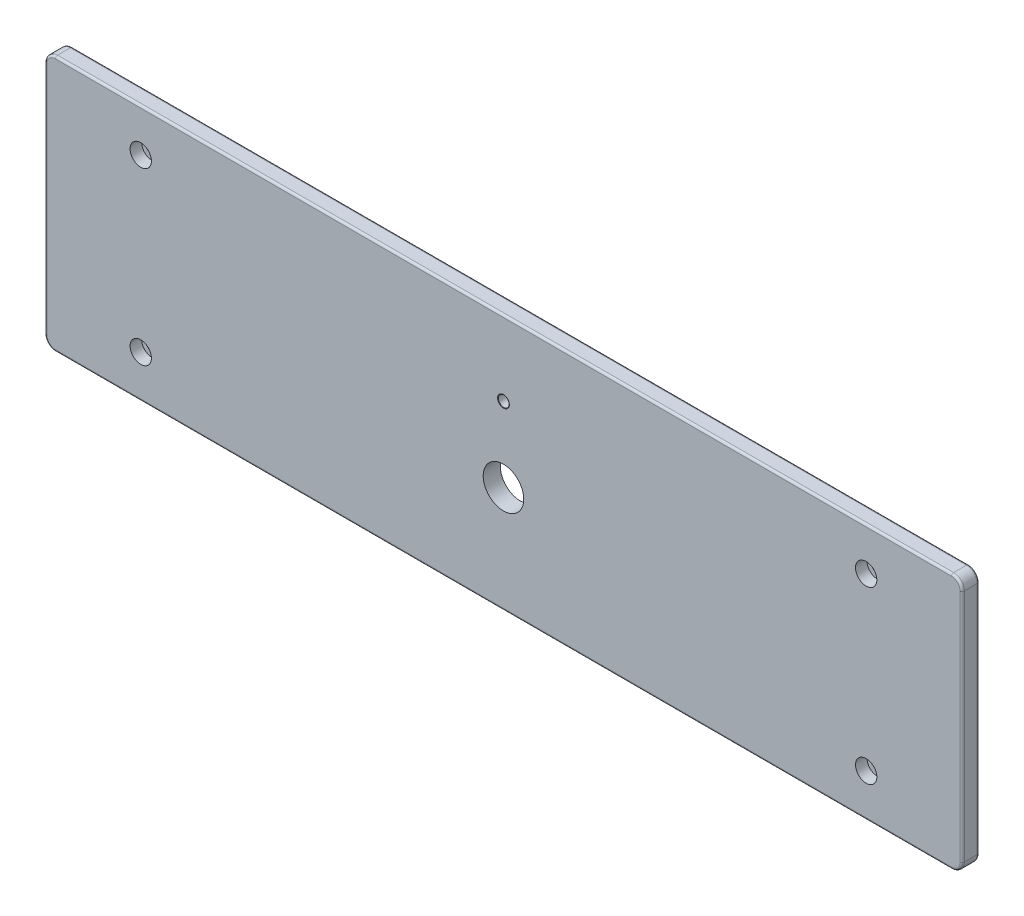
ISO-10303-21;
HEADER;
FILE_DESCRIPTION(('STEP AP214'),'2;1');
FILE_NAME('part.step','',(''),(''),'','','');
FILE_SCHEMA(('AUTOMOTIVE_DESIGN { 1 0 10303 214 1 1 1 1 }'));
ENDSEC;
DATA;
#1=APPLICATION_CONTEXT('core data for automotive mechanical design processes');
#2=APPLICATION_PROTOCOL_DEFINITION('international standard','automotive_design',2000,#1);
#3=PRODUCT_CONTEXT('',#1,'mechanical');
#4=PRODUCT('Part','Part','',(#3));
#5=PRODUCT_RELATED_PRODUCT_CATEGORY('part','',(#4));
#6=PRODUCT_DEFINITION_FORMATION('','',#4);
#7=PRODUCT_DEFINITION_CONTEXT('part definition',#1,'design');
#8=PRODUCT_DEFINITION('design','',#6,#7);
#9=PRODUCT_DEFINITION_SHAPE('','',#8);
#10=(LENGTH_UNIT() NAMED_UNIT(*) SI_UNIT(.MILLI.,.METRE.));
#11=(NAMED_UNIT(*) PLANE_ANGLE_UNIT() SI_UNIT($,.RADIAN.));
#12=(NAMED_UNIT(*) SI_UNIT($,.STERADIAN.) SOLID_ANGLE_UNIT());
#13=UNCERTAINTY_MEASURE_WITH_UNIT(LENGTH_MEASURE(1.E-05),#10,'distance_accuracy_value','');
#14=(GEOMETRIC_REPRESENTATION_CONTEXT(3) GLOBAL_UNCERTAINTY_ASSIGNED_CONTEXT((#13)) GLOBAL_UNIT_ASSIGNED_CONTEXT((#10,
#11,#12)) REPRESENTATION_CONTEXT('',''));
#15=CARTESIAN_POINT('',(0.,0.,0.));
#16=DIRECTION('',(0.,0.,1.));
#17=DIRECTION('',(1.,0.,0.));
#18=AXIS2_PLACEMENT_3D('',#15,#16,#17);
#19=CARTESIAN_POINT('',(0.,0.,8.));
#20=DIRECTION('',(1.,0.,0.));
#21=DIRECTION('',(0.,0.,-1.));
#22=AXIS2_PLACEMENT_3D('',#19,#20,#21);
#23=PLANE('',#22);
#24=DIRECTION('',(0.,0.,-1.));
#25=VECTOR('',#24,1.);
#26=CARTESIAN_POINT('',(0.,115.,8.));
#27=LINE('',#26,#25);
#28=CARTESIAN_POINT('',(0.,115.,7.));
#29=VERTEX_POINT('',#28);
#30=CARTESIAN_POINT('',(0.,115.,1.));
#31=VERTEX_POINT('',#30);
#32=EDGE_CURVE('E392',#29,#31,#27,.T.);
#33=ORIENTED_EDGE('',*,*,#32,.T.);
#34=DIRECTION('',(0.,-1.,0.));
#35=VECTOR('',#34,1.);
#36=CARTESIAN_POINT('',(0.,5.,1.));
#37=LINE('',#36,#35);
#38=CARTESIAN_POINT('',(0.,5.,1.));
#39=VERTEX_POINT('',#38);
#40=EDGE_CURVE('E199',#31,#39,#37,.T.);
#41=ORIENTED_EDGE('',*,*,#40,.T.);
#42=DIRECTION('',(0.,0.,-1.));
#43=VECTOR('',#42,1.);
#44=CARTESIAN_POINT('',(0.,5.,8.));
#45=LINE('',#44,#43);
#46=CARTESIAN_POINT('',(0.,5.,7.));
#47=VERTEX_POINT('',#46);
#48=EDGE_CURVE('E394',#39,#47,#45,.F.);
#49=ORIENTED_EDGE('',*,*,#48,.T.);
#50=DIRECTION('',(0.,-1.,0.));
#51=VECTOR('',#50,1.);
#52=CARTESIAN_POINT('',(0.,0.,7.));
#53=LINE('',#52,#51);
#54=EDGE_CURVE('E197',#47,#29,#53,.F.);
#55=ORIENTED_EDGE('',*,*,#54,.T.);
#56=EDGE_LOOP('',(#33,#41,#49,#55));
#57=FACE_BOUND('',#56,.T.);
#58=ADVANCED_FACE('F33',(#57),#23,.F.);
#59=CARTESIAN_POINT('',(0.,0.,8.));
#60=DIRECTION('',(0.,1.,0.));
#61=DIRECTION('',(0.,0.,1.));
#62=AXIS2_PLACEMENT_3D('',#59,#60,#61);
#63=PLANE('',#62);
#64=DIRECTION('',(0.,0.,-1.));
#65=VECTOR('',#64,1.);
#66=CARTESIAN_POINT('',(5.,0.,8.));
#67=LINE('',#66,#65);
#68=CARTESIAN_POINT('',(5.,0.,7.));
#69=VERTEX_POINT('',#68);
#70=CARTESIAN_POINT('',(5.,0.,1.));
#71=VERTEX_POINT('',#70);
#72=EDGE_CURVE('E386',#69,#71,#67,.T.);
#73=ORIENTED_EDGE('',*,*,#72,.T.);
#74=DIRECTION('',(1.,0.,0.));
#75=VECTOR('',#74,1.);
#76=CARTESIAN_POINT('',(425.,0.,1.));
#77=LINE('',#76,#75);
#78=CARTESIAN_POINT('',(425.,0.,1.));
#79=VERTEX_POINT('',#78);
#80=EDGE_CURVE('E207',#71,#79,#77,.T.);
#81=ORIENTED_EDGE('',*,*,#80,.T.);
#82=DIRECTION('',(0.,0.,-1.));
#83=VECTOR('',#82,1.);
#84=CARTESIAN_POINT('',(425.,0.,8.));
#85=LINE('',#84,#83);
#86=CARTESIAN_POINT('',(425.,0.,7.));
#87=VERTEX_POINT('',#86);
#88=EDGE_CURVE('E164',#79,#87,#85,.F.);
#89=ORIENTED_EDGE('',*,*,#88,.T.);
#90=DIRECTION('',(1.,0.,0.));
#91=VECTOR('',#90,1.);
#92=CARTESIAN_POINT('',(0.,0.,7.));
#93=LINE('',#92,#91);
#94=EDGE_CURVE('E205',#87,#69,#93,.F.);
#95=ORIENTED_EDGE('',*,*,#94,.T.);
#96=EDGE_LOOP('',(#73,#81,#89,#95));
#97=FACE_BOUND('',#96,.T.);
#98=ADVANCED_FACE('F289',(#97),#63,.F.);
#99=CARTESIAN_POINT('',(430.,0.,8.));
#100=DIRECTION('',(-1.,0.,0.));
#101=DIRECTION('',(0.,0.,1.));
#102=AXIS2_PLACEMENT_3D('',#99,#100,#101);
#103=PLANE('',#102);
#104=DIRECTION('',(0.,0.,-1.));
#105=VECTOR('',#104,1.);
#106=CARTESIAN_POINT('',(430.,5.,8.));
#107=LINE('',#106,#105);
#108=CARTESIAN_POINT('',(430.,5.,7.));
#109=VERTEX_POINT('',#108);
#110=CARTESIAN_POINT('',(430.,5.,1.));
#111=VERTEX_POINT('',#110);
#112=EDGE_CURVE('E403',#109,#111,#107,.T.);
#113=ORIENTED_EDGE('',*,*,#112,.T.);
#114=DIRECTION('',(0.,1.,0.));
#115=VECTOR('',#114,1.);
#116=CARTESIAN_POINT('',(430.,115.,1.));
#117=LINE('',#116,#115);
#118=CARTESIAN_POINT('',(430.,115.,1.));
#119=VERTEX_POINT('',#118);
#120=EDGE_CURVE('E215',#111,#119,#117,.T.);
#121=ORIENTED_EDGE('',*,*,#120,.T.);
#122=DIRECTION('',(0.,0.,-1.));
#123=VECTOR('',#122,1.);
#124=CARTESIAN_POINT('',(430.,115.,8.));
#125=LINE('',#124,#123);
#126=CARTESIAN_POINT('',(430.,115.,7.));
#127=VERTEX_POINT('',#126);
#128=EDGE_CURVE('E400',#119,#127,#125,.F.);
#129=ORIENTED_EDGE('',*,*,#128,.T.);
#130=DIRECTION('',(0.,1.,0.));
#131=VECTOR('',#130,1.);
#132=CARTESIAN_POINT('',(430.,0.,7.));
#133=LINE('',#132,#131);
#134=EDGE_CURVE('E213',#127,#109,#133,.F.);
#135=ORIENTED_EDGE('',*,*,#134,.T.);
#136=EDGE_LOOP('',(#113,#121,#129,#135));
#137=FACE_BOUND('',#136,.T.);
#138=ADVANCED_FACE('F295',(#137),#103,.F.);
#139=CARTESIAN_POINT('',(0.,120.,8.));
#140=DIRECTION('',(0.,-1.,0.));
#141=DIRECTION('',(0.,0.,-1.));
#142=AXIS2_PLACEMENT_3D('',#139,#140,#141);
#143=PLANE('',#142);
#144=DIRECTION('',(0.,0.,-1.));
#145=VECTOR('',#144,1.);
#146=CARTESIAN_POINT('',(425.,120.,8.));
#147=LINE('',#146,#145);
#148=CARTESIAN_POINT('',(425.,120.,7.));
#149=VERTEX_POINT('',#148);
#150=CARTESIAN_POINT('',(425.,120.,1.));
#151=VERTEX_POINT('',#150);
#152=EDGE_CURVE('E171',#149,#151,#147,.T.);
#153=ORIENTED_EDGE('',*,*,#152,.T.);
#154=DIRECTION('',(-1.,0.,0.));
#155=VECTOR('',#154,1.);
#156=CARTESIAN_POINT('',(5.,120.,1.));
#157=LINE('',#156,#155);
#158=CARTESIAN_POINT('',(5.,120.,1.));
#159=VERTEX_POINT('',#158);
#160=EDGE_CURVE('E234',#151,#159,#157,.T.);
#161=ORIENTED_EDGE('',*,*,#160,.T.);
#162=DIRECTION('',(0.,0.,-1.));
#163=VECTOR('',#162,1.);
#164=CARTESIAN_POINT('',(5.,120.,8.));
#165=LINE('',#164,#163);
#166=CARTESIAN_POINT('',(5.,120.,7.));
#167=VERTEX_POINT('',#166);
#168=EDGE_CURVE('E175',#159,#167,#165,.F.);
#169=ORIENTED_EDGE('',*,*,#168,.T.);
#170=DIRECTION('',(-1.,0.,0.));
#171=VECTOR('',#170,1.);
#172=CARTESIAN_POINT('',(0.,120.,7.));
#173=LINE('',#172,#171);
#174=EDGE_CURVE('E232',#167,#149,#173,.F.);
#175=ORIENTED_EDGE('',*,*,#174,.T.);
#176=EDGE_LOOP('',(#153,#161,#169,#175));
#177=FACE_BOUND('',#176,.T.);
#178=ADVANCED_FACE('F408',(#177),#143,.F.);
#179=CARTESIAN_POINT('',(0.,120.,8.));
#180=DIRECTION('',(0.,0.,-1.));
#181=DIRECTION('',(-1.,0.,0.));
#182=AXIS2_PLACEMENT_3D('',#179,#180,#181);
#183=PLANE('',#182);
#184=CARTESIAN_POINT('',(215.,85.,8.));
#185=DIRECTION('',(0.,0.,-1.));
#186=DIRECTION('',(-1.,0.,0.));
#187=AXIS2_PLACEMENT_3D('',#184,#185,#186);
#188=CIRCLE('',#187,2.74999999999995);
#189=CARTESIAN_POINT('',(212.25,85.,8.));
#190=VERTEX_POINT('',#189);
#191=EDGE_CURVE('E11',#190,#190,#188,.T.);
#192=ORIENTED_EDGE('',*,*,#191,.T.);
#193=EDGE_LOOP('',(#192));
#194=FACE_BOUND('',#193,.T.);
#195=CARTESIAN_POINT('',(215.,50.,8.));
#196=DIRECTION('',(0.,0.,1.));
#197=DIRECTION('',(1.,0.,0.));
#198=AXIS2_PLACEMENT_3D('',#195,#196,#197);
#199=CIRCLE('',#198,9.49999999999998);
#200=CARTESIAN_POINT('',(224.5,50.,8.));
#201=VERTEX_POINT('',#200);
#202=EDGE_CURVE('E839',#201,#201,#199,.T.);
#203=ORIENTED_EDGE('',*,*,#202,.F.);
#204=EDGE_LOOP('',(#203));
#205=FACE_BOUND('',#204,.T.);
#206=CARTESIAN_POINT('',(45.,100.,8.));
#207=DIRECTION('',(0.,0.,1.));
#208=DIRECTION('',(1.,0.,0.));
#209=AXIS2_PLACEMENT_3D('',#206,#207,#208);
#210=CIRCLE('',#209,4.99999999999999);
#211=CARTESIAN_POINT('',(50.,100.,8.));
#212=VERTEX_POINT('',#211);
#213=EDGE_CURVE('E756',#212,#212,#210,.T.);
#214=ORIENTED_EDGE('',*,*,#213,.F.);
#215=EDGE_LOOP('',(#214));
#216=FACE_BOUND('',#215,.T.);
#217=CARTESIAN_POINT('',(45.,20.,8.));
#218=DIRECTION('',(0.,0.,1.));
#219=DIRECTION('',(1.,0.,0.));
#220=AXIS2_PLACEMENT_3D('',#217,#218,#219);
#221=CIRCLE('',#220,4.99999999999999);
#222=CARTESIAN_POINT('',(50.,20.,8.));
#223=VERTEX_POINT('',#222);
#224=EDGE_CURVE('E772',#223,#223,#221,.T.);
#225=ORIENTED_EDGE('',*,*,#224,.F.);
#226=EDGE_LOOP('',(#225));
#227=FACE_BOUND('',#226,.T.);
#228=CARTESIAN_POINT('',(385.,20.,8.));
#229=DIRECTION('',(0.,0.,1.));
#230=DIRECTION('',(1.,0.,0.));
#231=AXIS2_PLACEMENT_3D('',#228,#229,#230);
#232=CIRCLE('',#231,5.);
#233=CARTESIAN_POINT('',(390.,20.,8.));
#234=VERTEX_POINT('',#233);
#235=EDGE_CURVE('E784',#234,#234,#232,.T.);
#236=ORIENTED_EDGE('',*,*,#235,.F.);
#237=EDGE_LOOP('',(#236));
#238=FACE_BOUND('',#237,.T.);
#239=CARTESIAN_POINT('',(385.,100.,8.));
#240=DIRECTION('',(0.,0.,1.));
#241=DIRECTION('',(1.,0.,0.));
#242=AXIS2_PLACEMENT_3D('',#239,#240,#241);
#243=CIRCLE('',#242,5.);
#244=CARTESIAN_POINT('',(390.,100.,8.));
#245=VERTEX_POINT('',#244);
#246=EDGE_CURVE('E796',#245,#245,#243,.T.);
#247=ORIENTED_EDGE('',*,*,#246,.F.);
#248=EDGE_LOOP('',(#247));
#249=FACE_BOUND('',#248,.T.);
#250=CARTESIAN_POINT('',(425.,5.,8.));
#251=DIRECTION('',(0.,0.,-1.));
#252=DIRECTION('',(-1.,0.,0.));
#253=AXIS2_PLACEMENT_3D('',#250,#251,#252);
#254=CIRCLE('',#253,4.);
#255=CARTESIAN_POINT('',(425.,1.,8.));
#256=VERTEX_POINT('',#255);
#257=CARTESIAN_POINT('',(429.,5.,8.));
#258=VERTEX_POINT('',#257);
#259=EDGE_CURVE('E48',#256,#258,#254,.F.);
#260=ORIENTED_EDGE('',*,*,#259,.T.);
#261=DIRECTION('',(0.,1.,0.));
#262=VECTOR('',#261,1.);
#263=CARTESIAN_POINT('',(429.,120.,8.));
#264=LINE('',#263,#262);
#265=CARTESIAN_POINT('',(429.,115.,8.));
#266=VERTEX_POINT('',#265);
#267=EDGE_CURVE('E230',#258,#266,#264,.T.);
#268=ORIENTED_EDGE('',*,*,#267,.T.);
#269=CARTESIAN_POINT('',(425.,115.,8.));
#270=DIRECTION('',(0.,0.,-1.));
#271=DIRECTION('',(-1.,0.,0.));
#272=AXIS2_PLACEMENT_3D('',#269,#270,#271);
#273=CIRCLE('',#272,4.);
#274=CARTESIAN_POINT('',(425.,119.,8.));
#275=VERTEX_POINT('',#274);
#276=EDGE_CURVE('E219',#266,#275,#273,.F.);
#277=ORIENTED_EDGE('',*,*,#276,.T.);
#278=DIRECTION('',(-1.,0.,0.));
#279=VECTOR('',#278,1.);
#280=CARTESIAN_POINT('',(0.,119.,8.));
#281=LINE('',#280,#279);
#282=CARTESIAN_POINT('',(5.,119.,8.));
#283=VERTEX_POINT('',#282);
#284=EDGE_CURVE('E217',#275,#283,#281,.T.);
#285=ORIENTED_EDGE('',*,*,#284,.T.);
#286=CARTESIAN_POINT('',(5.,115.,8.));
#287=DIRECTION('',(0.,0.,-1.));
#288=DIRECTION('',(-1.,0.,0.));
#289=AXIS2_PLACEMENT_3D('',#286,#287,#288);
#290=CIRCLE('',#289,4.);
#291=CARTESIAN_POINT('',(1.,115.,8.));
#292=VERTEX_POINT('',#291);
#293=EDGE_CURVE('E221',#283,#292,#290,.F.);
#294=ORIENTED_EDGE('',*,*,#293,.T.);
#295=DIRECTION('',(0.,-1.,0.));
#296=VECTOR('',#295,1.);
#297=CARTESIAN_POINT('',(1.,120.,8.));
#298=LINE('',#297,#296);
#299=CARTESIAN_POINT('',(1.,5.,8.));
#300=VERTEX_POINT('',#299);
#301=EDGE_CURVE('E224',#292,#300,#298,.T.);
#302=ORIENTED_EDGE('',*,*,#301,.T.);
#303=CARTESIAN_POINT('',(5.,5.,8.));
#304=DIRECTION('',(0.,0.,-1.));
#305=DIRECTION('',(-1.,0.,0.));
#306=AXIS2_PLACEMENT_3D('',#303,#304,#305);
#307=CIRCLE('',#306,4.);
#308=CARTESIAN_POINT('',(5.,1.,8.));
#309=VERTEX_POINT('',#308);
#310=EDGE_CURVE('E226',#300,#309,#307,.F.);
#311=ORIENTED_EDGE('',*,*,#310,.T.);
#312=DIRECTION('',(1.,0.,0.));
#313=VECTOR('',#312,1.);
#314=CARTESIAN_POINT('',(0.,1.,8.));
#315=LINE('',#314,#313);
#316=EDGE_CURVE('E53',#309,#256,#315,.T.);
#317=ORIENTED_EDGE('',*,*,#316,.T.);
#318=EDGE_LOOP('',(#260,#268,#277,#285,#294,#302,#311,#317));
#319=FACE_BOUND('',#318,.T.);
#320=ADVANCED_FACE('F420',(#194,#205,#216,#227,#238,#249,#319),#183,.F.);
#321=CARTESIAN_POINT('',(0.,120.,0.));
#322=DIRECTION('',(0.,0.,-1.));
#323=DIRECTION('',(-1.,0.,0.));
#324=AXIS2_PLACEMENT_3D('',#321,#322,#323);
#325=PLANE('',#324);
#326=CARTESIAN_POINT('',(215.,50.,0.));
#327=DIRECTION('',(0.,0.,1.));
#328=DIRECTION('',(1.,0.,0.));
#329=AXIS2_PLACEMENT_3D('',#326,#327,#328);
#330=CIRCLE('',#329,9.50000000000001);
#331=CARTESIAN_POINT('',(224.5,50.,0.));
#332=VERTEX_POINT('',#331);
#333=EDGE_CURVE('E763',#332,#332,#330,.T.);
#334=ORIENTED_EDGE('',*,*,#333,.T.);
#335=EDGE_LOOP('',(#334));
#336=FACE_BOUND('',#335,.T.);
#337=CARTESIAN_POINT('',(215.,85.,0.));
#338=DIRECTION('',(0.,0.,1.));
#339=DIRECTION('',(1.,0.,0.));
#340=AXIS2_PLACEMENT_3D('',#337,#338,#339);
#341=CIRCLE('',#340,2.5);
#342=CARTESIAN_POINT('',(217.5,85.,0.));
#343=VERTEX_POINT('',#342);
#344=EDGE_CURVE('E758',#343,#343,#341,.T.);
#345=ORIENTED_EDGE('',*,*,#344,.T.);
#346=EDGE_LOOP('',(#345));
#347=FACE_BOUND('',#346,.T.);
#348=CARTESIAN_POINT('',(45.,100.,0.));
#349=DIRECTION('',(0.,0.,1.));
#350=DIRECTION('',(1.,0.,0.));
#351=AXIS2_PLACEMENT_3D('',#348,#349,#350);
#352=CIRCLE('',#351,2.75000000000001);
#353=CARTESIAN_POINT('',(47.75,100.,0.));
#354=VERTEX_POINT('',#353);
#355=EDGE_CURVE('E769',#354,#354,#352,.T.);
#356=ORIENTED_EDGE('',*,*,#355,.T.);
#357=EDGE_LOOP('',(#356));
#358=FACE_BOUND('',#357,.T.);
#359=CARTESIAN_POINT('',(45.,20.,0.));
#360=DIRECTION('',(0.,0.,1.));
#361=DIRECTION('',(1.,0.,0.));
#362=AXIS2_PLACEMENT_3D('',#359,#360,#361);
#363=CIRCLE('',#362,2.75000000000001);
#364=CARTESIAN_POINT('',(47.75,20.,0.));
#365=VERTEX_POINT('',#364);
#366=EDGE_CURVE('E781',#365,#365,#363,.T.);
#367=ORIENTED_EDGE('',*,*,#366,.T.);
#368=EDGE_LOOP('',(#367));
#369=FACE_BOUND('',#368,.T.);
#370=CARTESIAN_POINT('',(385.,20.,0.));
#371=DIRECTION('',(0.,0.,1.));
#372=DIRECTION('',(1.,0.,0.));
#373=AXIS2_PLACEMENT_3D('',#370,#371,#372);
#374=CIRCLE('',#373,2.75000000000003);
#375=CARTESIAN_POINT('',(387.75,20.,0.));
#376=VERTEX_POINT('',#375);
#377=EDGE_CURVE('E793',#376,#376,#374,.T.);
#378=ORIENTED_EDGE('',*,*,#377,.T.);
#379=EDGE_LOOP('',(#378));
#380=FACE_BOUND('',#379,.T.);
#381=CARTESIAN_POINT('',(385.,100.,0.));
#382=DIRECTION('',(0.,0.,1.));
#383=DIRECTION('',(1.,0.,0.));
#384=AXIS2_PLACEMENT_3D('',#381,#382,#383);
#385=CIRCLE('',#384,2.75000000000003);
#386=CARTESIAN_POINT('',(387.75,100.,0.));
#387=VERTEX_POINT('',#386);
#388=EDGE_CURVE('E255',#387,#387,#385,.T.);
#389=ORIENTED_EDGE('',*,*,#388,.T.);
#390=EDGE_LOOP('',(#389));
#391=FACE_BOUND('',#390,.T.);
#392=DIRECTION('',(1.,0.,0.));
#393=VECTOR('',#392,1.);
#394=CARTESIAN_POINT('',(5.,1.,0.));
#395=LINE('',#394,#393);
#396=CARTESIAN_POINT('',(425.,1.,0.));
#397=VERTEX_POINT('',#396);
#398=CARTESIAN_POINT('',(5.,1.,0.));
#399=VERTEX_POINT('',#398);
#400=EDGE_CURVE('E184',#397,#399,#395,.F.);
#401=ORIENTED_EDGE('',*,*,#400,.T.);
#402=CARTESIAN_POINT('',(5.,5.,0.));
#403=DIRECTION('',(0.,0.,-1.));
#404=DIRECTION('',(-1.,0.,0.));
#405=AXIS2_PLACEMENT_3D('',#402,#403,#404);
#406=CIRCLE('',#405,4.);
#407=CARTESIAN_POINT('',(1.,5.,0.));
#408=VERTEX_POINT('',#407);
#409=EDGE_CURVE('E186',#399,#408,#406,.T.);
#410=ORIENTED_EDGE('',*,*,#409,.T.);
#411=DIRECTION('',(0.,-1.,0.));
#412=VECTOR('',#411,1.);
#413=CARTESIAN_POINT('',(1.,115.,0.));
#414=LINE('',#413,#412);
#415=CARTESIAN_POINT('',(1.,115.,0.));
#416=VERTEX_POINT('',#415);
#417=EDGE_CURVE('E150',#408,#416,#414,.F.);
#418=ORIENTED_EDGE('',*,*,#417,.T.);
#419=CARTESIAN_POINT('',(5.,115.,0.));
#420=DIRECTION('',(0.,0.,-1.));
#421=DIRECTION('',(-1.,0.,0.));
#422=AXIS2_PLACEMENT_3D('',#419,#420,#421);
#423=CIRCLE('',#422,4.);
#424=CARTESIAN_POINT('',(5.,119.,0.));
#425=VERTEX_POINT('',#424);
#426=EDGE_CURVE('E143',#416,#425,#423,.T.);
#427=ORIENTED_EDGE('',*,*,#426,.T.);
#428=DIRECTION('',(-1.,0.,0.));
#429=VECTOR('',#428,1.);
#430=CARTESIAN_POINT('',(425.,119.,0.));
#431=LINE('',#430,#429);
#432=CARTESIAN_POINT('',(425.,119.,0.));
#433=VERTEX_POINT('',#432);
#434=EDGE_CURVE('E147',#425,#433,#431,.F.);
#435=ORIENTED_EDGE('',*,*,#434,.T.);
#436=CARTESIAN_POINT('',(425.,115.,0.));
#437=DIRECTION('',(0.,0.,-1.));
#438=DIRECTION('',(-1.,0.,0.));
#439=AXIS2_PLACEMENT_3D('',#436,#437,#438);
#440=CIRCLE('',#439,4.);
#441=CARTESIAN_POINT('',(429.,115.,0.));
#442=VERTEX_POINT('',#441);
#443=EDGE_CURVE('E155',#433,#442,#440,.T.);
#444=ORIENTED_EDGE('',*,*,#443,.T.);
#445=DIRECTION('',(0.,1.,0.));
#446=VECTOR('',#445,1.);
#447=CARTESIAN_POINT('',(429.,5.,0.));
#448=LINE('',#447,#446);
#449=CARTESIAN_POINT('',(429.,5.,0.));
#450=VERTEX_POINT('',#449);
#451=EDGE_CURVE('E154',#442,#450,#448,.F.);
#452=ORIENTED_EDGE('',*,*,#451,.T.);
#453=CARTESIAN_POINT('',(425.,5.,0.));
#454=DIRECTION('',(0.,0.,-1.));
#455=DIRECTION('',(-1.,0.,0.));
#456=AXIS2_PLACEMENT_3D('',#453,#454,#455);
#457=CIRCLE('',#456,4.);
#458=EDGE_CURVE('E181',#450,#397,#457,.T.);
#459=ORIENTED_EDGE('',*,*,#458,.T.);
#460=EDGE_LOOP('',(#401,#410,#418,#427,#435,#444,#452,#459));
#461=FACE_BOUND('',#460,.T.);
#462=ADVANCED_FACE('F145',(#336,#347,#358,#369,#380,#391,#461),#325,.T.);
#463=CARTESIAN_POINT('',(5.,5.,8.));
#464=DIRECTION('',(0.,0.,-1.));
#465=DIRECTION('',(-1.,0.,0.));
#466=AXIS2_PLACEMENT_3D('',#463,#464,#465);
#467=CYLINDRICAL_SURFACE('',#466,5.);
#468=ORIENTED_EDGE('',*,*,#48,.F.);
#469=CARTESIAN_POINT('',(5.,5.,1.));
#470=DIRECTION('',(0.,0.,-1.));
#471=DIRECTION('',(-1.,0.,0.));
#472=AXIS2_PLACEMENT_3D('',#469,#470,#471);
#473=CIRCLE('',#472,5.);
#474=EDGE_CURVE('E203',#39,#71,#473,.F.);
#475=ORIENTED_EDGE('',*,*,#474,.T.);
#476=ORIENTED_EDGE('',*,*,#72,.F.);
#477=CARTESIAN_POINT('',(5.,5.,7.));
#478=DIRECTION('',(0.,0.,-1.));
#479=DIRECTION('',(-1.,0.,0.));
#480=AXIS2_PLACEMENT_3D('',#477,#478,#479);
#481=CIRCLE('',#480,5.);
#482=EDGE_CURVE('E201',#69,#47,#481,.T.);
#483=ORIENTED_EDGE('',*,*,#482,.T.);
#484=EDGE_LOOP('',(#468,#475,#476,#483));
#485=FACE_BOUND('',#484,.T.);
#486=ADVANCED_FACE('F301',(#485),#467,.T.);
#487=CARTESIAN_POINT('',(425.,5.,8.));
#488=DIRECTION('',(0.,0.,-1.));
#489=DIRECTION('',(-1.,0.,0.));
#490=AXIS2_PLACEMENT_3D('',#487,#488,#489);
#491=CYLINDRICAL_SURFACE('',#490,5.);
#492=ORIENTED_EDGE('',*,*,#88,.F.);
#493=CARTESIAN_POINT('',(425.,5.,1.));
#494=DIRECTION('',(0.,0.,-1.));
#495=DIRECTION('',(-1.,0.,0.));
#496=AXIS2_PLACEMENT_3D('',#493,#494,#495);
#497=CIRCLE('',#496,5.);
#498=EDGE_CURVE('E190',#79,#111,#497,.F.);
#499=ORIENTED_EDGE('',*,*,#498,.T.);
#500=ORIENTED_EDGE('',*,*,#112,.F.);
#501=CARTESIAN_POINT('',(425.,5.,7.));
#502=DIRECTION('',(0.,0.,-1.));
#503=DIRECTION('',(-1.,0.,0.));
#504=AXIS2_PLACEMENT_3D('',#501,#502,#503);
#505=CIRCLE('',#504,5.);
#506=EDGE_CURVE('E188',#109,#87,#505,.T.);
#507=ORIENTED_EDGE('',*,*,#506,.T.);
#508=EDGE_LOOP('',(#492,#499,#500,#507));
#509=FACE_BOUND('',#508,.T.);
#510=ADVANCED_FACE('F304',(#509),#491,.T.);
#511=CARTESIAN_POINT('',(425.,115.,8.));
#512=DIRECTION('',(0.,0.,-1.));
#513=DIRECTION('',(-1.,0.,0.));
#514=AXIS2_PLACEMENT_3D('',#511,#512,#513);
#515=CYLINDRICAL_SURFACE('',#514,5.);
#516=ORIENTED_EDGE('',*,*,#128,.F.);
#517=CARTESIAN_POINT('',(425.,115.,1.));
#518=DIRECTION('',(0.,0.,-1.));
#519=DIRECTION('',(-1.,0.,0.));
#520=AXIS2_PLACEMENT_3D('',#517,#518,#519);
#521=CIRCLE('',#520,5.);
#522=EDGE_CURVE('E211',#119,#151,#521,.F.);
#523=ORIENTED_EDGE('',*,*,#522,.T.);
#524=ORIENTED_EDGE('',*,*,#152,.F.);
#525=CARTESIAN_POINT('',(425.,115.,7.));
#526=DIRECTION('',(0.,0.,-1.));
#527=DIRECTION('',(-1.,0.,0.));
#528=AXIS2_PLACEMENT_3D('',#525,#526,#527);
#529=CIRCLE('',#528,5.);
#530=EDGE_CURVE('E209',#149,#127,#529,.T.);
#531=ORIENTED_EDGE('',*,*,#530,.T.);
#532=EDGE_LOOP('',(#516,#523,#524,#531));
#533=FACE_BOUND('',#532,.T.);
#534=ADVANCED_FACE('F308',(#533),#515,.T.);
#535=CARTESIAN_POINT('',(5.,115.,8.));
#536=DIRECTION('',(0.,0.,-1.));
#537=DIRECTION('',(-1.,0.,0.));
#538=AXIS2_PLACEMENT_3D('',#535,#536,#537);
#539=CYLINDRICAL_SURFACE('',#538,5.);
#540=ORIENTED_EDGE('',*,*,#168,.F.);
#541=CARTESIAN_POINT('',(5.,115.,1.));
#542=DIRECTION('',(0.,0.,-1.));
#543=DIRECTION('',(-1.,0.,0.));
#544=AXIS2_PLACEMENT_3D('',#541,#542,#543);
#545=CIRCLE('',#544,5.);
#546=EDGE_CURVE('E161',#159,#31,#545,.F.);
#547=ORIENTED_EDGE('',*,*,#546,.T.);
#548=ORIENTED_EDGE('',*,*,#32,.F.);
#549=CARTESIAN_POINT('',(5.,115.,7.));
#550=DIRECTION('',(0.,0.,-1.));
#551=DIRECTION('',(-1.,0.,0.));
#552=AXIS2_PLACEMENT_3D('',#549,#550,#551);
#553=CIRCLE('',#552,5.);
#554=EDGE_CURVE('E193',#29,#167,#553,.T.);
#555=ORIENTED_EDGE('',*,*,#554,.T.);
#556=EDGE_LOOP('',(#540,#547,#548,#555));
#557=FACE_BOUND('',#556,.T.);
#558=ADVANCED_FACE('F312',(#557),#539,.T.);
#559=CARTESIAN_POINT('',(5.,115.,1.));
#560=DIRECTION('',(0.,0.,-1.));
#561=DIRECTION('',(-1.,0.,0.));
#562=AXIS2_PLACEMENT_3D('',#559,#560,#561);
#563=TOROIDAL_SURFACE('',#562,4.,1.);
#564=CARTESIAN_POINT('',(1.,115.,1.));
#565=DIRECTION('',(0.,-1.,0.));
#566=DIRECTION('',(0.,0.,-1.));
#567=AXIS2_PLACEMENT_3D('',#564,#565,#566);
#568=CIRCLE('',#567,1.);
#569=EDGE_CURVE('E165',#31,#416,#568,.T.);
#570=ORIENTED_EDGE('',*,*,#569,.F.);
#571=ORIENTED_EDGE('',*,*,#546,.F.);
#572=CARTESIAN_POINT('',(5.,119.,1.));
#573=DIRECTION('',(1.,0.,0.));
#574=DIRECTION('',(0.,0.,-1.));
#575=AXIS2_PLACEMENT_3D('',#572,#573,#574);
#576=CIRCLE('',#575,1.);
#577=EDGE_CURVE('E159',#425,#159,#576,.T.);
#578=ORIENTED_EDGE('',*,*,#577,.F.);
#579=ORIENTED_EDGE('',*,*,#426,.F.);
#580=EDGE_LOOP('',(#570,#571,#578,#579));
#581=FACE_BOUND('',#580,.T.);
#582=ADVANCED_FACE('F160',(#581),#563,.T.);
#583=CARTESIAN_POINT('',(0.,119.,1.));
#584=DIRECTION('',(1.,0.,0.));
#585=DIRECTION('',(0.,0.,-1.));
#586=AXIS2_PLACEMENT_3D('',#583,#584,#585);
#587=CYLINDRICAL_SURFACE('',#586,1.);
#588=ORIENTED_EDGE('',*,*,#577,.T.);
#589=ORIENTED_EDGE('',*,*,#160,.F.);
#590=CARTESIAN_POINT('',(425.,119.,1.));
#591=DIRECTION('',(1.,0.,0.));
#592=DIRECTION('',(0.,0.,-1.));
#593=AXIS2_PLACEMENT_3D('',#590,#591,#592);
#594=CIRCLE('',#593,1.);
#595=EDGE_CURVE('E169',#433,#151,#594,.T.);
#596=ORIENTED_EDGE('',*,*,#595,.F.);
#597=ORIENTED_EDGE('',*,*,#434,.F.);
#598=EDGE_LOOP('',(#588,#589,#596,#597));
#599=FACE_BOUND('',#598,.T.);
#600=ADVANCED_FACE('F167',(#599),#587,.T.);
#601=CARTESIAN_POINT('',(1.,0.,1.));
#602=DIRECTION('',(0.,1.,0.));
#603=DIRECTION('',(0.,0.,1.));
#604=AXIS2_PLACEMENT_3D('',#601,#602,#603);
#605=CYLINDRICAL_SURFACE('',#604,1.);
#606=ORIENTED_EDGE('',*,*,#569,.T.);
#607=ORIENTED_EDGE('',*,*,#417,.F.);
#608=CARTESIAN_POINT('',(1.,5.,1.));
#609=DIRECTION('',(0.,-1.,0.));
#610=DIRECTION('',(0.,0.,-1.));
#611=AXIS2_PLACEMENT_3D('',#608,#609,#610);
#612=CIRCLE('',#611,1.);
#613=EDGE_CURVE('E247',#39,#408,#612,.T.);
#614=ORIENTED_EDGE('',*,*,#613,.F.);
#615=ORIENTED_EDGE('',*,*,#40,.F.);
#616=EDGE_LOOP('',(#606,#607,#614,#615));
#617=FACE_BOUND('',#616,.T.);
#618=ADVANCED_FACE('F337',(#617),#605,.T.);
#619=CARTESIAN_POINT('',(425.,115.,1.));
#620=DIRECTION('',(0.,0.,-1.));
#621=DIRECTION('',(-1.,0.,0.));
#622=AXIS2_PLACEMENT_3D('',#619,#620,#621);
#623=TOROIDAL_SURFACE('',#622,4.,1.);
#624=ORIENTED_EDGE('',*,*,#595,.T.);
#625=ORIENTED_EDGE('',*,*,#522,.F.);
#626=CARTESIAN_POINT('',(429.,115.,1.));
#627=DIRECTION('',(0.,-1.,0.));
#628=DIRECTION('',(0.,0.,-1.));
#629=AXIS2_PLACEMENT_3D('',#626,#627,#628);
#630=CIRCLE('',#629,1.);
#631=EDGE_CURVE('E244',#442,#119,#630,.T.);
#632=ORIENTED_EDGE('',*,*,#631,.F.);
#633=ORIENTED_EDGE('',*,*,#443,.F.);
#634=EDGE_LOOP('',(#624,#625,#632,#633));
#635=FACE_BOUND('',#634,.T.);
#636=ADVANCED_FACE('F333',(#635),#623,.T.);
#637=CARTESIAN_POINT('',(5.,5.,1.));
#638=DIRECTION('',(0.,0.,-1.));
#639=DIRECTION('',(-1.,0.,0.));
#640=AXIS2_PLACEMENT_3D('',#637,#638,#639);
#641=TOROIDAL_SURFACE('',#640,4.,1.);
#642=ORIENTED_EDGE('',*,*,#613,.T.);
#643=ORIENTED_EDGE('',*,*,#409,.F.);
#644=CARTESIAN_POINT('',(5.,1.,1.));
#645=DIRECTION('',(1.,0.,0.));
#646=DIRECTION('',(0.,0.,-1.));
#647=AXIS2_PLACEMENT_3D('',#644,#645,#646);
#648=CIRCLE('',#647,1.);
#649=EDGE_CURVE('E241',#71,#399,#648,.T.);
#650=ORIENTED_EDGE('',*,*,#649,.F.);
#651=ORIENTED_EDGE('',*,*,#474,.F.);
#652=EDGE_LOOP('',(#642,#643,#650,#651));
#653=FACE_BOUND('',#652,.T.);
#654=ADVANCED_FACE('F329',(#653),#641,.T.);
#655=CARTESIAN_POINT('',(429.,0.,1.));
#656=DIRECTION('',(0.,-1.,0.));
#657=DIRECTION('',(0.,0.,-1.));
#658=AXIS2_PLACEMENT_3D('',#655,#656,#657);
#659=CYLINDRICAL_SURFACE('',#658,1.);
#660=ORIENTED_EDGE('',*,*,#631,.T.);
#661=ORIENTED_EDGE('',*,*,#120,.F.);
#662=CARTESIAN_POINT('',(429.,5.,1.));
#663=DIRECTION('',(0.,-1.,0.));
#664=DIRECTION('',(0.,0.,-1.));
#665=AXIS2_PLACEMENT_3D('',#662,#663,#664);
#666=CIRCLE('',#665,1.);
#667=EDGE_CURVE('E238',#450,#111,#666,.T.);
#668=ORIENTED_EDGE('',*,*,#667,.F.);
#669=ORIENTED_EDGE('',*,*,#451,.F.);
#670=EDGE_LOOP('',(#660,#661,#668,#669));
#671=FACE_BOUND('',#670,.T.);
#672=ADVANCED_FACE('F325',(#671),#659,.T.);
#673=CARTESIAN_POINT('',(0.,1.,1.));
#674=DIRECTION('',(-1.,0.,0.));
#675=DIRECTION('',(0.,0.,1.));
#676=AXIS2_PLACEMENT_3D('',#673,#674,#675);
#677=CYLINDRICAL_SURFACE('',#676,1.);
#678=ORIENTED_EDGE('',*,*,#649,.T.);
#679=ORIENTED_EDGE('',*,*,#400,.F.);
#680=CARTESIAN_POINT('',(425.,1.,1.));
#681=DIRECTION('',(1.,0.,0.));
#682=DIRECTION('',(0.,0.,-1.));
#683=AXIS2_PLACEMENT_3D('',#680,#681,#682);
#684=CIRCLE('',#683,1.);
#685=EDGE_CURVE('E236',#79,#397,#684,.T.);
#686=ORIENTED_EDGE('',*,*,#685,.F.);
#687=ORIENTED_EDGE('',*,*,#80,.F.);
#688=EDGE_LOOP('',(#678,#679,#686,#687));
#689=FACE_BOUND('',#688,.T.);
#690=ADVANCED_FACE('F321',(#689),#677,.T.);
#691=CARTESIAN_POINT('',(425.,5.,1.));
#692=DIRECTION('',(0.,0.,-1.));
#693=DIRECTION('',(-1.,0.,0.));
#694=AXIS2_PLACEMENT_3D('',#691,#692,#693);
#695=TOROIDAL_SURFACE('',#694,4.,1.);
#696=ORIENTED_EDGE('',*,*,#667,.T.);
#697=ORIENTED_EDGE('',*,*,#498,.F.);
#698=ORIENTED_EDGE('',*,*,#685,.T.);
#699=ORIENTED_EDGE('',*,*,#458,.F.);
#700=EDGE_LOOP('',(#696,#697,#698,#699));
#701=FACE_BOUND('',#700,.T.);
#702=ADVANCED_FACE('F317',(#701),#695,.T.);
#703=CARTESIAN_POINT('',(425.,5.,7.));
#704=DIRECTION('',(0.,0.,-1.));
#705=DIRECTION('',(-1.,0.,0.));
#706=AXIS2_PLACEMENT_3D('',#703,#704,#705);
#707=TOROIDAL_SURFACE('',#706,4.,1.);
#708=CARTESIAN_POINT('',(425.,1.,7.));
#709=DIRECTION('',(-1.,0.,0.));
#710=DIRECTION('',(0.,0.,1.));
#711=AXIS2_PLACEMENT_3D('',#708,#709,#710);
#712=CIRCLE('',#711,1.);
#713=EDGE_CURVE('E269',#87,#256,#712,.T.);
#714=ORIENTED_EDGE('',*,*,#713,.F.);
#715=ORIENTED_EDGE('',*,*,#506,.F.);
#716=CARTESIAN_POINT('',(429.,5.,7.));
#717=DIRECTION('',(0.,1.,0.));
#718=DIRECTION('',(0.,0.,1.));
#719=AXIS2_PLACEMENT_3D('',#716,#717,#718);
#720=CIRCLE('',#719,1.);
#721=EDGE_CURVE('E239',#258,#109,#720,.T.);
#722=ORIENTED_EDGE('',*,*,#721,.F.);
#723=ORIENTED_EDGE('',*,*,#259,.F.);
#724=EDGE_LOOP('',(#714,#715,#722,#723));
#725=FACE_BOUND('',#724,.T.);
#726=ADVANCED_FACE('F320',(#725),#707,.T.);
#727=CARTESIAN_POINT('',(429.,120.,7.));
#728=DIRECTION('',(0.,1.,0.));
#729=DIRECTION('',(0.,0.,1.));
#730=AXIS2_PLACEMENT_3D('',#727,#728,#729);
#731=CYLINDRICAL_SURFACE('',#730,1.);
#732=ORIENTED_EDGE('',*,*,#721,.T.);
#733=ORIENTED_EDGE('',*,*,#134,.F.);
#734=CARTESIAN_POINT('',(429.,115.,7.));
#735=DIRECTION('',(0.,1.,0.));
#736=DIRECTION('',(0.,0.,1.));
#737=AXIS2_PLACEMENT_3D('',#734,#735,#736);
#738=CIRCLE('',#737,1.);
#739=EDGE_CURVE('E266',#266,#127,#738,.T.);
#740=ORIENTED_EDGE('',*,*,#739,.F.);
#741=ORIENTED_EDGE('',*,*,#267,.F.);
#742=EDGE_LOOP('',(#732,#733,#740,#741));
#743=FACE_BOUND('',#742,.T.);
#744=ADVANCED_FACE('F370',(#743),#731,.T.);
#745=CARTESIAN_POINT('',(0.,1.,7.));
#746=DIRECTION('',(1.,0.,0.));
#747=DIRECTION('',(0.,0.,-1.));
#748=AXIS2_PLACEMENT_3D('',#745,#746,#747);
#749=CYLINDRICAL_SURFACE('',#748,1.);
#750=ORIENTED_EDGE('',*,*,#713,.T.);
#751=ORIENTED_EDGE('',*,*,#316,.F.);
#752=CARTESIAN_POINT('',(5.,1.,7.));
#753=DIRECTION('',(-1.,0.,0.));
#754=DIRECTION('',(0.,0.,1.));
#755=AXIS2_PLACEMENT_3D('',#752,#753,#754);
#756=CIRCLE('',#755,1.);
#757=EDGE_CURVE('E263',#69,#309,#756,.T.);
#758=ORIENTED_EDGE('',*,*,#757,.F.);
#759=ORIENTED_EDGE('',*,*,#94,.F.);
#760=EDGE_LOOP('',(#750,#751,#758,#759));
#761=FACE_BOUND('',#760,.T.);
#762=ADVANCED_FACE('F366',(#761),#749,.T.);
#763=CARTESIAN_POINT('',(425.,115.,7.));
#764=DIRECTION('',(0.,0.,-1.));
#765=DIRECTION('',(-1.,0.,0.));
#766=AXIS2_PLACEMENT_3D('',#763,#764,#765);
#767=TOROIDAL_SURFACE('',#766,4.,1.);
#768=ORIENTED_EDGE('',*,*,#739,.T.);
#769=ORIENTED_EDGE('',*,*,#530,.F.);
#770=CARTESIAN_POINT('',(425.,119.,7.));
#771=DIRECTION('',(-1.,0.,0.));
#772=DIRECTION('',(0.,0.,1.));
#773=AXIS2_PLACEMENT_3D('',#770,#771,#772);
#774=CIRCLE('',#773,1.);
#775=EDGE_CURVE('E260',#275,#149,#774,.T.);
#776=ORIENTED_EDGE('',*,*,#775,.F.);
#777=ORIENTED_EDGE('',*,*,#276,.F.);
#778=EDGE_LOOP('',(#768,#769,#776,#777));
#779=FACE_BOUND('',#778,.T.);
#780=ADVANCED_FACE('F362',(#779),#767,.T.);
#781=CARTESIAN_POINT('',(5.,5.,7.));
#782=DIRECTION('',(0.,0.,-1.));
#783=DIRECTION('',(-1.,0.,0.));
#784=AXIS2_PLACEMENT_3D('',#781,#782,#783);
#785=TOROIDAL_SURFACE('',#784,4.,1.);
#786=ORIENTED_EDGE('',*,*,#757,.T.);
#787=ORIENTED_EDGE('',*,*,#310,.F.);
#788=CARTESIAN_POINT('',(1.,5.,7.));
#789=DIRECTION('',(0.,1.,0.));
#790=DIRECTION('',(0.,0.,1.));
#791=AXIS2_PLACEMENT_3D('',#788,#789,#790);
#792=CIRCLE('',#791,1.);
#793=EDGE_CURVE('E257',#47,#300,#792,.T.);
#794=ORIENTED_EDGE('',*,*,#793,.F.);
#795=ORIENTED_EDGE('',*,*,#482,.F.);
#796=EDGE_LOOP('',(#786,#787,#794,#795));
#797=FACE_BOUND('',#796,.T.);
#798=ADVANCED_FACE('F358',(#797),#785,.T.);
#799=CARTESIAN_POINT('',(0.,119.,7.));
#800=DIRECTION('',(-1.,0.,0.));
#801=DIRECTION('',(0.,0.,1.));
#802=AXIS2_PLACEMENT_3D('',#799,#800,#801);
#803=CYLINDRICAL_SURFACE('',#802,1.);
#804=ORIENTED_EDGE('',*,*,#775,.T.);
#805=ORIENTED_EDGE('',*,*,#174,.F.);
#806=CARTESIAN_POINT('',(5.,119.,7.));
#807=DIRECTION('',(-1.,0.,0.));
#808=DIRECTION('',(0.,0.,1.));
#809=AXIS2_PLACEMENT_3D('',#806,#807,#808);
#810=CIRCLE('',#809,1.);
#811=EDGE_CURVE('E254',#283,#167,#810,.T.);
#812=ORIENTED_EDGE('',*,*,#811,.F.);
#813=ORIENTED_EDGE('',*,*,#284,.F.);
#814=EDGE_LOOP('',(#804,#805,#812,#813));
#815=FACE_BOUND('',#814,.T.);
#816=ADVANCED_FACE('F354',(#815),#803,.T.);
#817=CARTESIAN_POINT('',(1.,120.,7.));
#818=DIRECTION('',(0.,-1.,0.));
#819=DIRECTION('',(0.,0.,-1.));
#820=AXIS2_PLACEMENT_3D('',#817,#818,#819);
#821=CYLINDRICAL_SURFACE('',#820,1.);
#822=ORIENTED_EDGE('',*,*,#793,.T.);
#823=ORIENTED_EDGE('',*,*,#301,.F.);
#824=CARTESIAN_POINT('',(1.,115.,7.));
#825=DIRECTION('',(0.,1.,0.));
#826=DIRECTION('',(0.,0.,1.));
#827=AXIS2_PLACEMENT_3D('',#824,#825,#826);
#828=CIRCLE('',#827,1.);
#829=EDGE_CURVE('E252',#29,#292,#828,.T.);
#830=ORIENTED_EDGE('',*,*,#829,.F.);
#831=ORIENTED_EDGE('',*,*,#54,.F.);
#832=EDGE_LOOP('',(#822,#823,#830,#831));
#833=FACE_BOUND('',#832,.T.);
#834=ADVANCED_FACE('F350',(#833),#821,.T.);
#835=CARTESIAN_POINT('',(5.,115.,7.));
#836=DIRECTION('',(0.,0.,-1.));
#837=DIRECTION('',(-1.,0.,0.));
#838=AXIS2_PLACEMENT_3D('',#835,#836,#837);
#839=TOROIDAL_SURFACE('',#838,4.,1.);
#840=ORIENTED_EDGE('',*,*,#811,.T.);
#841=ORIENTED_EDGE('',*,*,#554,.F.);
#842=ORIENTED_EDGE('',*,*,#829,.T.);
#843=ORIENTED_EDGE('',*,*,#293,.F.);
#844=EDGE_LOOP('',(#840,#841,#842,#843));
#845=FACE_BOUND('',#844,.T.);
#846=ADVANCED_FACE('F346',(#845),#839,.T.);
#847=CARTESIAN_POINT('',(385.,100.,8.));
#848=DIRECTION('',(0.,0.,1.));
#849=DIRECTION('',(1.,0.,0.));
#850=AXIS2_PLACEMENT_3D('',#847,#848,#849);
#851=CYLINDRICAL_SURFACE('',#850,2.75000000000003);
#852=ORIENTED_EDGE('',*,*,#388,.F.);
#853=EDGE_LOOP('',(#852));
#854=FACE_BOUND('',#853,.T.);
#855=CARTESIAN_POINT('',(385.,100.,2.6));
#856=DIRECTION('',(0.,0.,1.));
#857=DIRECTION('',(1.,0.,0.));
#858=AXIS2_PLACEMENT_3D('',#855,#856,#857);
#859=CIRCLE('',#858,2.75000000000003);
#860=CARTESIAN_POINT('',(387.75,100.,2.6));
#861=VERTEX_POINT('',#860);
#862=EDGE_CURVE('E802',#861,#861,#859,.T.);
#863=ORIENTED_EDGE('',*,*,#862,.T.);
#864=EDGE_LOOP('',(#863));
#865=FACE_BOUND('',#864,.T.);
#866=ADVANCED_FACE('F349',(#854,#865),#851,.F.);
#867=CARTESIAN_POINT('',(387.75,100.,2.6));
#868=DIRECTION('',(0.,0.,-1.));
#869=DIRECTION('',(-1.,0.,0.));
#870=AXIS2_PLACEMENT_3D('',#867,#868,#869);
#871=PLANE('',#870);
#872=ORIENTED_EDGE('',*,*,#862,.F.);
#873=EDGE_LOOP('',(#872));
#874=FACE_BOUND('',#873,.T.);
#875=CARTESIAN_POINT('',(385.,100.,2.6));
#876=DIRECTION('',(0.,0.,1.));
#877=DIRECTION('',(1.,0.,0.));
#878=AXIS2_PLACEMENT_3D('',#875,#876,#877);
#879=CIRCLE('',#878,5.);
#880=CARTESIAN_POINT('',(390.,100.,2.6));
#881=VERTEX_POINT('',#880);
#882=EDGE_CURVE('E799',#881,#881,#879,.T.);
#883=ORIENTED_EDGE('',*,*,#882,.T.);
#884=EDGE_LOOP('',(#883));
#885=FACE_BOUND('',#884,.T.);
#886=ADVANCED_FACE('F458',(#874,#885),#871,.F.);
#887=CARTESIAN_POINT('',(385.,100.,8.));
#888=DIRECTION('',(0.,0.,1.));
#889=DIRECTION('',(1.,0.,0.));
#890=AXIS2_PLACEMENT_3D('',#887,#888,#889);
#891=CYLINDRICAL_SURFACE('',#890,5.);
#892=ORIENTED_EDGE('',*,*,#882,.F.);
#893=EDGE_LOOP('',(#892));
#894=FACE_BOUND('',#893,.T.);
#895=ORIENTED_EDGE('',*,*,#246,.T.);
#896=EDGE_LOOP('',(#895));
#897=FACE_BOUND('',#896,.T.);
#898=ADVANCED_FACE('F462',(#894,#897),#891,.F.);
#899=CARTESIAN_POINT('',(385.,20.,8.));
#900=DIRECTION('',(0.,0.,1.));
#901=DIRECTION('',(1.,0.,0.));
#902=AXIS2_PLACEMENT_3D('',#899,#900,#901);
#903=CYLINDRICAL_SURFACE('',#902,2.75000000000003);
#904=ORIENTED_EDGE('',*,*,#377,.F.);
#905=EDGE_LOOP('',(#904));
#906=FACE_BOUND('',#905,.T.);
#907=CARTESIAN_POINT('',(385.,20.,2.6));
#908=DIRECTION('',(0.,0.,1.));
#909=DIRECTION('',(1.,0.,0.));
#910=AXIS2_PLACEMENT_3D('',#907,#908,#909);
#911=CIRCLE('',#910,2.75000000000003);
#912=CARTESIAN_POINT('',(387.75,20.,2.6));
#913=VERTEX_POINT('',#912);
#914=EDGE_CURVE('E790',#913,#913,#911,.T.);
#915=ORIENTED_EDGE('',*,*,#914,.T.);
#916=EDGE_LOOP('',(#915));
#917=FACE_BOUND('',#916,.T.);
#918=ADVANCED_FACE('F466',(#906,#917),#903,.F.);
#919=CARTESIAN_POINT('',(387.75,20.,2.6));
#920=DIRECTION('',(0.,0.,-1.));
#921=DIRECTION('',(-1.,0.,0.));
#922=AXIS2_PLACEMENT_3D('',#919,#920,#921);
#923=PLANE('',#922);
#924=ORIENTED_EDGE('',*,*,#914,.F.);
#925=EDGE_LOOP('',(#924));
#926=FACE_BOUND('',#925,.T.);
#927=CARTESIAN_POINT('',(385.,20.,2.6));
#928=DIRECTION('',(0.,0.,1.));
#929=DIRECTION('',(1.,0.,0.));
#930=AXIS2_PLACEMENT_3D('',#927,#928,#929);
#931=CIRCLE('',#930,5.);
#932=CARTESIAN_POINT('',(390.,20.,2.6));
#933=VERTEX_POINT('',#932);
#934=EDGE_CURVE('E787',#933,#933,#931,.T.);
#935=ORIENTED_EDGE('',*,*,#934,.T.);
#936=EDGE_LOOP('',(#935));
#937=FACE_BOUND('',#936,.T.);
#938=ADVANCED_FACE('F470',(#926,#937),#923,.F.);
#939=CARTESIAN_POINT('',(385.,20.,8.));
#940=DIRECTION('',(0.,0.,1.));
#941=DIRECTION('',(1.,0.,0.));
#942=AXIS2_PLACEMENT_3D('',#939,#940,#941);
#943=CYLINDRICAL_SURFACE('',#942,5.);
#944=ORIENTED_EDGE('',*,*,#934,.F.);
#945=EDGE_LOOP('',(#944));
#946=FACE_BOUND('',#945,.T.);
#947=ORIENTED_EDGE('',*,*,#235,.T.);
#948=EDGE_LOOP('',(#947));
#949=FACE_BOUND('',#948,.T.);
#950=ADVANCED_FACE('F474',(#946,#949),#943,.F.);
#951=CARTESIAN_POINT('',(45.,20.,8.));
#952=DIRECTION('',(0.,0.,1.));
#953=DIRECTION('',(1.,0.,0.));
#954=AXIS2_PLACEMENT_3D('',#951,#952,#953);
#955=CYLINDRICAL_SURFACE('',#954,2.75000000000001);
#956=ORIENTED_EDGE('',*,*,#366,.F.);
#957=EDGE_LOOP('',(#956));
#958=FACE_BOUND('',#957,.T.);
#959=CARTESIAN_POINT('',(45.,20.,2.6));
#960=DIRECTION('',(0.,0.,1.));
#961=DIRECTION('',(1.,0.,0.));
#962=AXIS2_PLACEMENT_3D('',#959,#960,#961);
#963=CIRCLE('',#962,2.75000000000001);
#964=CARTESIAN_POINT('',(47.75,20.,2.6));
#965=VERTEX_POINT('',#964);
#966=EDGE_CURVE('E778',#965,#965,#963,.T.);
#967=ORIENTED_EDGE('',*,*,#966,.T.);
#968=EDGE_LOOP('',(#967));
#969=FACE_BOUND('',#968,.T.);
#970=ADVANCED_FACE('F478',(#958,#969),#955,.F.);
#971=CARTESIAN_POINT('',(47.75,20.,2.6));
#972=DIRECTION('',(0.,0.,-1.));
#973=DIRECTION('',(-1.,0.,0.));
#974=AXIS2_PLACEMENT_3D('',#971,#972,#973);
#975=PLANE('',#974);
#976=ORIENTED_EDGE('',*,*,#966,.F.);
#977=EDGE_LOOP('',(#976));
#978=FACE_BOUND('',#977,.T.);
#979=CARTESIAN_POINT('',(45.,20.,2.6));
#980=DIRECTION('',(0.,0.,1.));
#981=DIRECTION('',(1.,0.,0.));
#982=AXIS2_PLACEMENT_3D('',#979,#980,#981);
#983=CIRCLE('',#982,5.);
#984=CARTESIAN_POINT('',(50.,20.,2.6));
#985=VERTEX_POINT('',#984);
#986=EDGE_CURVE('E775',#985,#985,#983,.T.);
#987=ORIENTED_EDGE('',*,*,#986,.T.);
#988=EDGE_LOOP('',(#987));
#989=FACE_BOUND('',#988,.T.);
#990=ADVANCED_FACE('F482',(#978,#989),#975,.F.);
#991=CARTESIAN_POINT('',(45.,20.,8.));
#992=DIRECTION('',(0.,0.,1.));
#993=DIRECTION('',(1.,0.,0.));
#994=AXIS2_PLACEMENT_3D('',#991,#992,#993);
#995=CYLINDRICAL_SURFACE('',#994,4.99999999999999);
#996=ORIENTED_EDGE('',*,*,#986,.F.);
#997=EDGE_LOOP('',(#996));
#998=FACE_BOUND('',#997,.T.);
#999=ORIENTED_EDGE('',*,*,#224,.T.);
#1000=EDGE_LOOP('',(#999));
#1001=FACE_BOUND('',#1000,.T.);
#1002=ADVANCED_FACE('F486',(#998,#1001),#995,.F.);
#1003=CARTESIAN_POINT('',(45.,100.,8.));
#1004=DIRECTION('',(0.,0.,1.));
#1005=DIRECTION('',(1.,0.,0.));
#1006=AXIS2_PLACEMENT_3D('',#1003,#1004,#1005);
#1007=CYLINDRICAL_SURFACE('',#1006,2.75000000000001);
#1008=ORIENTED_EDGE('',*,*,#355,.F.);
#1009=EDGE_LOOP('',(#1008));
#1010=FACE_BOUND('',#1009,.T.);
#1011=CARTESIAN_POINT('',(45.,100.,2.6));
#1012=DIRECTION('',(0.,0.,1.));
#1013=DIRECTION('',(1.,0.,0.));
#1014=AXIS2_PLACEMENT_3D('',#1011,#1012,#1013);
#1015=CIRCLE('',#1014,2.75000000000001);
#1016=CARTESIAN_POINT('',(47.75,100.,2.6));
#1017=VERTEX_POINT('',#1016);
#1018=EDGE_CURVE('E760',#1017,#1017,#1015,.T.);
#1019=ORIENTED_EDGE('',*,*,#1018,.T.);
#1020=EDGE_LOOP('',(#1019));
#1021=FACE_BOUND('',#1020,.T.);
#1022=ADVANCED_FACE('F490',(#1010,#1021),#1007,.F.);
#1023=CARTESIAN_POINT('',(47.75,100.,2.6));
#1024=DIRECTION('',(0.,0.,-1.));
#1025=DIRECTION('',(-1.,0.,0.));
#1026=AXIS2_PLACEMENT_3D('',#1023,#1024,#1025);
#1027=PLANE('',#1026);
#1028=ORIENTED_EDGE('',*,*,#1018,.F.);
#1029=EDGE_LOOP('',(#1028));
#1030=FACE_BOUND('',#1029,.T.);
#1031=CARTESIAN_POINT('',(45.,100.,2.6));
#1032=DIRECTION('',(0.,0.,1.));
#1033=DIRECTION('',(1.,0.,0.));
#1034=AXIS2_PLACEMENT_3D('',#1031,#1032,#1033);
#1035=CIRCLE('',#1034,5.);
#1036=CARTESIAN_POINT('',(50.,100.,2.6));
#1037=VERTEX_POINT('',#1036);
#1038=EDGE_CURVE('E753',#1037,#1037,#1035,.T.);
#1039=ORIENTED_EDGE('',*,*,#1038,.T.);
#1040=EDGE_LOOP('',(#1039));
#1041=FACE_BOUND('',#1040,.T.);
#1042=ADVANCED_FACE('F494',(#1030,#1041),#1027,.F.);
#1043=CARTESIAN_POINT('',(45.,100.,8.));
#1044=DIRECTION('',(0.,0.,1.));
#1045=DIRECTION('',(1.,0.,0.));
#1046=AXIS2_PLACEMENT_3D('',#1043,#1044,#1045);
#1047=CYLINDRICAL_SURFACE('',#1046,4.99999999999999);
#1048=ORIENTED_EDGE('',*,*,#1038,.F.);
#1049=EDGE_LOOP('',(#1048));
#1050=FACE_BOUND('',#1049,.T.);
#1051=ORIENTED_EDGE('',*,*,#213,.T.);
#1052=EDGE_LOOP('',(#1051));
#1053=FACE_BOUND('',#1052,.T.);
#1054=ADVANCED_FACE('F498',(#1050,#1053),#1047,.F.);
#1055=CARTESIAN_POINT('',(215.,85.,8.));
#1056=DIRECTION('',(0.,0.,1.));
#1057=DIRECTION('',(1.,0.,0.));
#1058=AXIS2_PLACEMENT_3D('',#1055,#1056,#1057);
#1059=CYLINDRICAL_SURFACE('',#1058,2.49999999999999);
#1060=CARTESIAN_POINT('',(215.,85.,7.85566243270261));
#1061=DIRECTION('',(0.,0.,-1.));
#1062=DIRECTION('',(-1.,0.,0.));
#1063=AXIS2_PLACEMENT_3D('',#1060,#1061,#1062);
#1064=CIRCLE('',#1063,2.49999999999999);
#1065=CARTESIAN_POINT('',(212.5,85.,7.85566243270261));
#1066=VERTEX_POINT('',#1065);
#1067=EDGE_CURVE('E41',#1066,#1066,#1064,.F.);
#1068=ORIENTED_EDGE('',*,*,#1067,.T.);
#1069=EDGE_LOOP('',(#1068));
#1070=FACE_BOUND('',#1069,.T.);
#1071=ORIENTED_EDGE('',*,*,#344,.F.);
#1072=EDGE_LOOP('',(#1071));
#1073=FACE_BOUND('',#1072,.T.);
#1074=ADVANCED_FACE('F276',(#1070,#1073),#1059,.F.);
#1075=CARTESIAN_POINT('',(215.,50.,8.));
#1076=DIRECTION('',(0.,0.,1.));
#1077=DIRECTION('',(1.,0.,0.));
#1078=AXIS2_PLACEMENT_3D('',#1075,#1076,#1077);
#1079=CYLINDRICAL_SURFACE('',#1078,9.49999999999999);
#1080=ORIENTED_EDGE('',*,*,#333,.F.);
#1081=EDGE_LOOP('',(#1080));
#1082=FACE_BOUND('',#1081,.T.);
#1083=ORIENTED_EDGE('',*,*,#202,.T.);
#1084=EDGE_LOOP('',(#1083));
#1085=FACE_BOUND('',#1084,.T.);
#1086=ADVANCED_FACE('F280',(#1082,#1085),#1079,.F.);
#1087=CARTESIAN_POINT('',(215.,85.,7.85566243270261));
#1088=DIRECTION('',(0.,0.,1.));
#1089=DIRECTION('',(1.,0.,0.));
#1090=AXIS2_PLACEMENT_3D('',#1087,#1088,#1089);
#1091=CONICAL_SURFACE('',#1090,2.49999999999999,1.04719755119656);
#1092=ORIENTED_EDGE('',*,*,#191,.F.);
#1093=EDGE_LOOP('',(#1092));
#1094=FACE_BOUND('',#1093,.T.);
#1095=ORIENTED_EDGE('',*,*,#1067,.F.);
#1096=EDGE_LOOP('',(#1095));
#1097=FACE_BOUND('',#1096,.T.);
#1098=ADVANCED_FACE('F35',(#1094,#1097),#1091,.F.);
#1099=CLOSED_SHELL('',(#58,#98,#138,#178,#320,#462,#486,#510,#534,#558,#582,#600,#618,#636,#654,
#672,#690,#702,#726,#744,#762,#780,#798,#816,#834,#846,#866,#886,#898,#918,#938,#950,#970,#990,
#1002,#1022,#1042,#1054,#1074,#1086,#1098));
#1100=MANIFOLD_SOLID_BREP('B2',#1099);
#1101=ADVANCED_BREP_SHAPE_REPRESENTATION('',(#18,#1100),#14);
#1102=SHAPE_DEFINITION_REPRESENTATION(#9,#1101);
ENDSEC;
END-ISO-10303-21;
